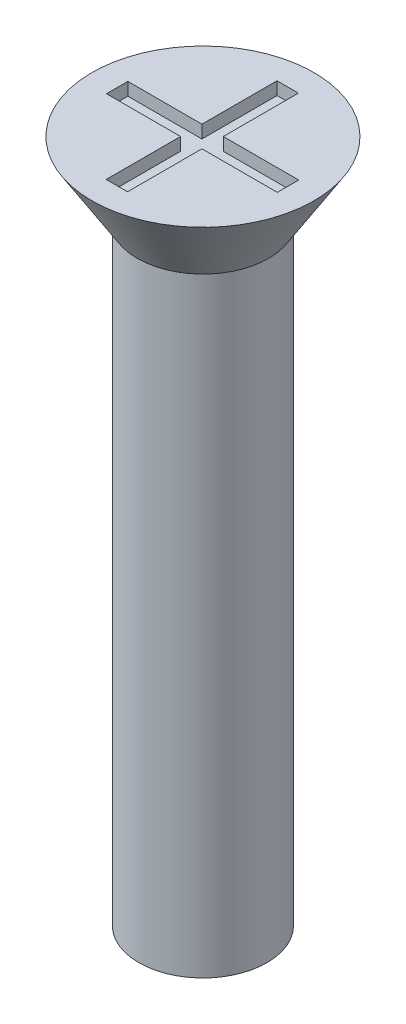
ISO-10303-21;
HEADER;
FILE_DESCRIPTION(('STEP AP214'),'2;1');
FILE_NAME('part.step','',(''),(''),'','','');
FILE_SCHEMA(('AUTOMOTIVE_DESIGN { 1 0 10303 214 1 1 1 1 }'));
ENDSEC;
DATA;
#1=APPLICATION_CONTEXT('core data for automotive mechanical design processes');
#2=APPLICATION_PROTOCOL_DEFINITION('international standard','automotive_design',2000,#1);
#3=PRODUCT_CONTEXT('',#1,'mechanical');
#4=PRODUCT('Part','Part','',(#3));
#5=PRODUCT_RELATED_PRODUCT_CATEGORY('part','',(#4));
#6=PRODUCT_DEFINITION_FORMATION('','',#4);
#7=PRODUCT_DEFINITION_CONTEXT('part definition',#1,'design');
#8=PRODUCT_DEFINITION('design','',#6,#7);
#9=PRODUCT_DEFINITION_SHAPE('','',#8);
#10=(LENGTH_UNIT() NAMED_UNIT(*) SI_UNIT(.MILLI.,.METRE.));
#11=(NAMED_UNIT(*) PLANE_ANGLE_UNIT() SI_UNIT($,.RADIAN.));
#12=(NAMED_UNIT(*) SI_UNIT($,.STERADIAN.) SOLID_ANGLE_UNIT());
#13=UNCERTAINTY_MEASURE_WITH_UNIT(LENGTH_MEASURE(1.E-05),#10,'distance_accuracy_value','');
#14=(GEOMETRIC_REPRESENTATION_CONTEXT(3) GLOBAL_UNCERTAINTY_ASSIGNED_CONTEXT((#13)) GLOBAL_UNIT_ASSIGNED_CONTEXT((#10,
#11,#12)) REPRESENTATION_CONTEXT('',''));
#15=CARTESIAN_POINT('',(0.,0.,0.));
#16=DIRECTION('',(0.,0.,1.));
#17=DIRECTION('',(1.,0.,0.));
#18=AXIS2_PLACEMENT_3D('',#15,#16,#17);
#19=CARTESIAN_POINT('',(0.,16.,0.));
#20=DIRECTION('',(0.,1.,0.));
#21=DIRECTION('',(0.,0.,1.));
#22=AXIS2_PLACEMENT_3D('',#19,#20,#21);
#23=PLANE('',#22);
#24=CARTESIAN_POINT('',(0.,16.,0.));
#25=DIRECTION('',(0.,1.,0.));
#26=DIRECTION('',(0.,0.,1.));
#27=AXIS2_PLACEMENT_3D('',#24,#25,#26);
#28=CIRCLE('',#27,2.6);
#29=CARTESIAN_POINT('',(0.,16.,2.6));
#30=VERTEX_POINT('',#29);
#31=EDGE_CURVE('E192',#30,#30,#28,.T.);
#32=ORIENTED_EDGE('',*,*,#31,.T.);
#33=EDGE_LOOP('',(#32));
#34=FACE_BOUND('',#33,.T.);
#35=DIRECTION('',(1.,0.,0.));
#36=VECTOR('',#35,1.);
#37=CARTESIAN_POINT('',(0.,16.,-2.));
#38=LINE('',#37,#36);
#39=CARTESIAN_POINT('',(-0.265272843023468,16.,-2.));
#40=VERTEX_POINT('',#39);
#41=CARTESIAN_POINT('',(0.234727156976532,16.,-2.));
#42=VERTEX_POINT('',#41);
#43=EDGE_CURVE('E161',#40,#42,#38,.T.);
#44=ORIENTED_EDGE('',*,*,#43,.T.);
#45=DIRECTION('',(0.,0.,1.));
#46=VECTOR('',#45,1.);
#47=CARTESIAN_POINT('',(0.234727156976532,16.,0.));
#48=LINE('',#47,#46);
#49=CARTESIAN_POINT('',(0.234727156976532,16.,-0.241621514992573));
#50=VERTEX_POINT('',#49);
#51=EDGE_CURVE('E48',#42,#50,#48,.T.);
#52=ORIENTED_EDGE('',*,*,#51,.T.);
#53=DIRECTION('',(1.,0.,0.));
#54=VECTOR('',#53,1.);
#55=CARTESIAN_POINT('',(0.,16.,-0.241621514992573));
#56=LINE('',#55,#54);
#57=CARTESIAN_POINT('',(2.,16.,-0.241621514992573));
#58=VERTEX_POINT('',#57);
#59=EDGE_CURVE('E98',#50,#58,#56,.T.);
#60=ORIENTED_EDGE('',*,*,#59,.T.);
#61=DIRECTION('',(0.,0.,1.));
#62=VECTOR('',#61,1.);
#63=CARTESIAN_POINT('',(2.,16.,0.));
#64=LINE('',#63,#62);
#65=CARTESIAN_POINT('',(2.,16.,0.258378485007427));
#66=VERTEX_POINT('',#65);
#67=EDGE_CURVE('E186',#58,#66,#64,.T.);
#68=ORIENTED_EDGE('',*,*,#67,.T.);
#69=DIRECTION('',(1.,0.,0.));
#70=VECTOR('',#69,1.);
#71=CARTESIAN_POINT('',(0.,16.,0.258378485007427));
#72=LINE('',#71,#70);
#73=CARTESIAN_POINT('',(0.234727156976532,16.,0.258378485007427));
#74=VERTEX_POINT('',#73);
#75=EDGE_CURVE('E145',#74,#66,#72,.T.);
#76=ORIENTED_EDGE('',*,*,#75,.F.);
#77=DIRECTION('',(0.,0.,1.));
#78=VECTOR('',#77,1.);
#79=CARTESIAN_POINT('',(0.234727156976532,16.,0.));
#80=LINE('',#79,#78);
#81=CARTESIAN_POINT('',(0.234727156976533,16.,2.));
#82=VERTEX_POINT('',#81);
#83=EDGE_CURVE('E182',#74,#82,#80,.T.);
#84=ORIENTED_EDGE('',*,*,#83,.T.);
#85=DIRECTION('',(1.,0.,0.));
#86=VECTOR('',#85,1.);
#87=CARTESIAN_POINT('',(0.,16.,2.));
#88=LINE('',#87,#86);
#89=CARTESIAN_POINT('',(-0.265272843023467,16.,2.));
#90=VERTEX_POINT('',#89);
#91=EDGE_CURVE('E179',#90,#82,#88,.T.);
#92=ORIENTED_EDGE('',*,*,#91,.F.);
#93=DIRECTION('',(0.,0.,1.));
#94=VECTOR('',#93,1.);
#95=CARTESIAN_POINT('',(-0.265272843023468,16.,0.));
#96=LINE('',#95,#94);
#97=CARTESIAN_POINT('',(-0.265272843023468,16.,0.258378485007427));
#98=VERTEX_POINT('',#97);
#99=EDGE_CURVE('E176',#98,#90,#96,.T.);
#100=ORIENTED_EDGE('',*,*,#99,.F.);
#101=DIRECTION('',(1.,0.,0.));
#102=VECTOR('',#101,1.);
#103=CARTESIAN_POINT('',(0.,16.,0.258378485007427));
#104=LINE('',#103,#102);
#105=CARTESIAN_POINT('',(-2.,16.,0.258378485007427));
#106=VERTEX_POINT('',#105);
#107=EDGE_CURVE('E173',#106,#98,#104,.T.);
#108=ORIENTED_EDGE('',*,*,#107,.F.);
#109=DIRECTION('',(0.,0.,1.));
#110=VECTOR('',#109,1.);
#111=CARTESIAN_POINT('',(-2.,16.,0.));
#112=LINE('',#111,#110);
#113=CARTESIAN_POINT('',(-2.,16.,-0.241621514992573));
#114=VERTEX_POINT('',#113);
#115=EDGE_CURVE('E170',#114,#106,#112,.T.);
#116=ORIENTED_EDGE('',*,*,#115,.F.);
#117=DIRECTION('',(1.,0.,0.));
#118=VECTOR('',#117,1.);
#119=CARTESIAN_POINT('',(0.,16.,-0.241621514992573));
#120=LINE('',#119,#118);
#121=CARTESIAN_POINT('',(-0.265272843023468,16.,-0.241621514992573));
#122=VERTEX_POINT('',#121);
#123=EDGE_CURVE('E167',#114,#122,#120,.T.);
#124=ORIENTED_EDGE('',*,*,#123,.T.);
#125=DIRECTION('',(0.,0.,1.));
#126=VECTOR('',#125,1.);
#127=CARTESIAN_POINT('',(-0.265272843023468,16.,0.));
#128=LINE('',#127,#126);
#129=EDGE_CURVE('E164',#40,#122,#128,.T.);
#130=ORIENTED_EDGE('',*,*,#129,.F.);
#131=EDGE_LOOP('',(#44,#52,#60,#68,#76,#84,#92,#100,#108,#116,#124,#130));
#132=FACE_BOUND('',#131,.T.);
#133=ADVANCED_FACE('F33',(#34,#132),#23,.T.);
#134=CARTESIAN_POINT('',(0.,16.,0.));
#135=DIRECTION('',(0.,-1.,0.));
#136=DIRECTION('',(0.,0.,-1.));
#137=AXIS2_PLACEMENT_3D('',#134,#135,#136);
#138=CYLINDRICAL_SURFACE('',#137,1.5);
#139=CARTESIAN_POINT('',(0.,0.,0.));
#140=DIRECTION('',(0.,1.,0.));
#141=DIRECTION('',(0.,0.,1.));
#142=AXIS2_PLACEMENT_3D('',#139,#140,#141);
#143=CIRCLE('',#142,1.5);
#144=CARTESIAN_POINT('',(0.,0.,1.5));
#145=VERTEX_POINT('',#144);
#146=EDGE_CURVE('E41',#145,#145,#143,.T.);
#147=ORIENTED_EDGE('',*,*,#146,.T.);
#148=EDGE_LOOP('',(#147));
#149=FACE_BOUND('',#148,.T.);
#150=CARTESIAN_POINT('',(0.,14.3,0.));
#151=DIRECTION('',(0.,1.,0.));
#152=DIRECTION('',(0.,0.,1.));
#153=AXIS2_PLACEMENT_3D('',#150,#151,#152);
#154=CIRCLE('',#153,1.5);
#155=CARTESIAN_POINT('',(0.,14.3,1.5));
#156=VERTEX_POINT('',#155);
#157=EDGE_CURVE('E11',#156,#156,#154,.T.);
#158=ORIENTED_EDGE('',*,*,#157,.F.);
#159=EDGE_LOOP('',(#158));
#160=FACE_BOUND('',#159,.T.);
#161=ADVANCED_FACE('F35',(#149,#160),#138,.T.);
#162=CARTESIAN_POINT('',(0.,0.,0.));
#163=DIRECTION('',(0.,1.,0.));
#164=DIRECTION('',(0.,0.,1.));
#165=AXIS2_PLACEMENT_3D('',#162,#163,#164);
#166=PLANE('',#165);
#167=ORIENTED_EDGE('',*,*,#146,.F.);
#168=EDGE_LOOP('',(#167));
#169=FACE_BOUND('',#168,.T.);
#170=ADVANCED_FACE('F219',(#169),#166,.F.);
#171=CARTESIAN_POINT('',(0.,16.,0.));
#172=DIRECTION('',(0.,1.,0.));
#173=DIRECTION('',(0.,0.,1.));
#174=AXIS2_PLACEMENT_3D('',#171,#172,#173);
#175=CONICAL_SURFACE('',#174,2.6,0.558505360638187);
#176=CARTESIAN_POINT('',(0.,14.3,0.));
#177=DIRECTION('',(0.,1.,0.));
#178=DIRECTION('',(0.,0.,1.));
#179=AXIS2_PLACEMENT_3D('',#176,#177,#178);
#180=CIRCLE('',#179,1.53772210175414);
#181=CARTESIAN_POINT('',(0.,14.3,1.53772210175414));
#182=VERTEX_POINT('',#181);
#183=EDGE_CURVE('E212',#182,#182,#180,.T.);
#184=ORIENTED_EDGE('',*,*,#183,.T.);
#185=EDGE_LOOP('',(#184));
#186=FACE_BOUND('',#185,.T.);
#187=ORIENTED_EDGE('',*,*,#31,.F.);
#188=EDGE_LOOP('',(#187));
#189=FACE_BOUND('',#188,.T.);
#190=ADVANCED_FACE('F221',(#186,#189),#175,.T.);
#191=CARTESIAN_POINT('',(0.,14.3,0.));
#192=DIRECTION('',(0.,1.,0.));
#193=DIRECTION('',(0.,0.,1.));
#194=AXIS2_PLACEMENT_3D('',#191,#192,#193);
#195=PLANE('',#194);
#196=ORIENTED_EDGE('',*,*,#157,.T.);
#197=EDGE_LOOP('',(#196));
#198=FACE_BOUND('',#197,.T.);
#199=ORIENTED_EDGE('',*,*,#183,.F.);
#200=EDGE_LOOP('',(#199));
#201=FACE_BOUND('',#200,.T.);
#202=ADVANCED_FACE('F226',(#198,#201),#195,.F.);
#203=CARTESIAN_POINT('',(0.234727156976532,15.7,0.));
#204=DIRECTION('',(-1.,0.,0.));
#205=DIRECTION('',(0.,0.,1.));
#206=AXIS2_PLACEMENT_3D('',#203,#204,#205);
#207=PLANE('',#206);
#208=ORIENTED_EDGE('',*,*,#51,.F.);
#209=DIRECTION('',(0.,1.,0.));
#210=VECTOR('',#209,1.);
#211=CARTESIAN_POINT('',(0.234727156976532,15.7,-2.));
#212=LINE('',#211,#210);
#213=CARTESIAN_POINT('',(0.234727156976532,15.7,-2.));
#214=VERTEX_POINT('',#213);
#215=EDGE_CURVE('E159',#214,#42,#212,.T.);
#216=ORIENTED_EDGE('',*,*,#215,.F.);
#217=DIRECTION('',(0.,0.,1.));
#218=VECTOR('',#217,1.);
#219=CARTESIAN_POINT('',(0.234727156976532,15.7,0.));
#220=LINE('',#219,#218);
#221=CARTESIAN_POINT('',(0.234727156976532,15.7,-0.241621514992573));
#222=VERTEX_POINT('',#221);
#223=EDGE_CURVE('E189',#214,#222,#220,.T.);
#224=ORIENTED_EDGE('',*,*,#223,.T.);
#225=DIRECTION('',(0.,1.,0.));
#226=VECTOR('',#225,1.);
#227=CARTESIAN_POINT('',(0.234727156976532,15.7,-0.241621514992573));
#228=LINE('',#227,#226);
#229=EDGE_CURVE('E190',#222,#50,#228,.T.);
#230=ORIENTED_EDGE('',*,*,#229,.T.);
#231=EDGE_LOOP('',(#208,#216,#224,#230));
#232=FACE_BOUND('',#231,.T.);
#233=ADVANCED_FACE('F238',(#232),#207,.T.);
#234=CARTESIAN_POINT('',(0.,15.7,-0.241621514992573));
#235=DIRECTION('',(0.,0.,1.));
#236=DIRECTION('',(1.,0.,0.));
#237=AXIS2_PLACEMENT_3D('',#234,#235,#236);
#238=PLANE('',#237);
#239=ORIENTED_EDGE('',*,*,#59,.F.);
#240=ORIENTED_EDGE('',*,*,#229,.F.);
#241=DIRECTION('',(1.,0.,0.));
#242=VECTOR('',#241,1.);
#243=CARTESIAN_POINT('',(0.,15.7,-0.241621514992573));
#244=LINE('',#243,#242);
#245=CARTESIAN_POINT('',(2.,15.7,-0.241621514992573));
#246=VERTEX_POINT('',#245);
#247=EDGE_CURVE('E57',#222,#246,#244,.T.);
#248=ORIENTED_EDGE('',*,*,#247,.T.);
#249=DIRECTION('',(0.,1.,0.));
#250=VECTOR('',#249,1.);
#251=CARTESIAN_POINT('',(2.,15.7,-0.241621514992573));
#252=LINE('',#251,#250);
#253=EDGE_CURVE('E137',#246,#58,#252,.T.);
#254=ORIENTED_EDGE('',*,*,#253,.T.);
#255=EDGE_LOOP('',(#239,#240,#248,#254));
#256=FACE_BOUND('',#255,.T.);
#257=ADVANCED_FACE('F242',(#256),#238,.T.);
#258=CARTESIAN_POINT('',(2.,15.7,0.));
#259=DIRECTION('',(-1.,0.,0.));
#260=DIRECTION('',(0.,0.,1.));
#261=AXIS2_PLACEMENT_3D('',#258,#259,#260);
#262=PLANE('',#261);
#263=ORIENTED_EDGE('',*,*,#67,.F.);
#264=ORIENTED_EDGE('',*,*,#253,.F.);
#265=DIRECTION('',(0.,0.,1.));
#266=VECTOR('',#265,1.);
#267=CARTESIAN_POINT('',(2.,15.7,0.));
#268=LINE('',#267,#266);
#269=CARTESIAN_POINT('',(2.,15.7,0.258378485007427));
#270=VERTEX_POINT('',#269);
#271=EDGE_CURVE('E131',#246,#270,#268,.T.);
#272=ORIENTED_EDGE('',*,*,#271,.T.);
#273=DIRECTION('',(0.,1.,0.));
#274=VECTOR('',#273,1.);
#275=CARTESIAN_POINT('',(2.,15.7,0.258378485007427));
#276=LINE('',#275,#274);
#277=EDGE_CURVE('E135',#270,#66,#276,.T.);
#278=ORIENTED_EDGE('',*,*,#277,.T.);
#279=EDGE_LOOP('',(#263,#264,#272,#278));
#280=FACE_BOUND('',#279,.T.);
#281=ADVANCED_FACE('F134',(#280),#262,.T.);
#282=CARTESIAN_POINT('',(0.,15.7,0.258378485007427));
#283=DIRECTION('',(0.,0.,1.));
#284=DIRECTION('',(1.,0.,0.));
#285=AXIS2_PLACEMENT_3D('',#282,#283,#284);
#286=PLANE('',#285);
#287=ORIENTED_EDGE('',*,*,#75,.T.);
#288=ORIENTED_EDGE('',*,*,#277,.F.);
#289=DIRECTION('',(1.,0.,0.));
#290=VECTOR('',#289,1.);
#291=CARTESIAN_POINT('',(0.,15.7,0.258378485007427));
#292=LINE('',#291,#290);
#293=CARTESIAN_POINT('',(0.234727156976532,15.7,0.258378485007427));
#294=VERTEX_POINT('',#293);
#295=EDGE_CURVE('E139',#294,#270,#292,.T.);
#296=ORIENTED_EDGE('',*,*,#295,.F.);
#297=DIRECTION('',(0.,1.,0.));
#298=VECTOR('',#297,1.);
#299=CARTESIAN_POINT('',(0.234727156976532,15.7,0.258378485007427));
#300=LINE('',#299,#298);
#301=EDGE_CURVE('E147',#294,#74,#300,.T.);
#302=ORIENTED_EDGE('',*,*,#301,.T.);
#303=EDGE_LOOP('',(#287,#288,#296,#302));
#304=FACE_BOUND('',#303,.T.);
#305=ADVANCED_FACE('F143',(#304),#286,.F.);
#306=CARTESIAN_POINT('',(0.234727156976532,15.7,0.));
#307=DIRECTION('',(-1.,0.,0.));
#308=DIRECTION('',(0.,0.,1.));
#309=AXIS2_PLACEMENT_3D('',#306,#307,#308);
#310=PLANE('',#309);
#311=ORIENTED_EDGE('',*,*,#83,.F.);
#312=ORIENTED_EDGE('',*,*,#301,.F.);
#313=DIRECTION('',(0.,0.,1.));
#314=VECTOR('',#313,1.);
#315=CARTESIAN_POINT('',(0.234727156976532,15.7,0.));
#316=LINE('',#315,#314);
#317=CARTESIAN_POINT('',(0.234727156976533,15.7,2.));
#318=VERTEX_POINT('',#317);
#319=EDGE_CURVE('E152',#294,#318,#316,.T.);
#320=ORIENTED_EDGE('',*,*,#319,.T.);
#321=DIRECTION('',(0.,1.,0.));
#322=VECTOR('',#321,1.);
#323=CARTESIAN_POINT('',(0.234727156976533,15.7,2.));
#324=LINE('',#323,#322);
#325=EDGE_CURVE('E195',#318,#82,#324,.T.);
#326=ORIENTED_EDGE('',*,*,#325,.T.);
#327=EDGE_LOOP('',(#311,#312,#320,#326));
#328=FACE_BOUND('',#327,.T.);
#329=ADVANCED_FACE('F269',(#328),#310,.T.);
#330=CARTESIAN_POINT('',(0.,15.7,2.));
#331=DIRECTION('',(0.,0.,1.));
#332=DIRECTION('',(1.,0.,0.));
#333=AXIS2_PLACEMENT_3D('',#330,#331,#332);
#334=PLANE('',#333);
#335=ORIENTED_EDGE('',*,*,#91,.T.);
#336=ORIENTED_EDGE('',*,*,#325,.F.);
#337=DIRECTION('',(1.,0.,0.));
#338=VECTOR('',#337,1.);
#339=CARTESIAN_POINT('',(0.,15.7,2.));
#340=LINE('',#339,#338);
#341=CARTESIAN_POINT('',(-0.265272843023467,15.7,2.));
#342=VERTEX_POINT('',#341);
#343=EDGE_CURVE('E154',#342,#318,#340,.T.);
#344=ORIENTED_EDGE('',*,*,#343,.F.);
#345=DIRECTION('',(0.,1.,0.));
#346=VECTOR('',#345,1.);
#347=CARTESIAN_POINT('',(-0.265272843023467,15.7,2.));
#348=LINE('',#347,#346);
#349=EDGE_CURVE('E197',#342,#90,#348,.T.);
#350=ORIENTED_EDGE('',*,*,#349,.T.);
#351=EDGE_LOOP('',(#335,#336,#344,#350));
#352=FACE_BOUND('',#351,.T.);
#353=ADVANCED_FACE('F265',(#352),#334,.F.);
#354=CARTESIAN_POINT('',(-0.265272843023468,15.7,0.));
#355=DIRECTION('',(-1.,0.,0.));
#356=DIRECTION('',(0.,0.,1.));
#357=AXIS2_PLACEMENT_3D('',#354,#355,#356);
#358=PLANE('',#357);
#359=ORIENTED_EDGE('',*,*,#99,.T.);
#360=ORIENTED_EDGE('',*,*,#349,.F.);
#361=DIRECTION('',(0.,0.,1.));
#362=VECTOR('',#361,1.);
#363=CARTESIAN_POINT('',(-0.265272843023468,15.7,0.));
#364=LINE('',#363,#362);
#365=CARTESIAN_POINT('',(-0.265272843023468,15.7,0.258378485007427));
#366=VERTEX_POINT('',#365);
#367=EDGE_CURVE('E417',#366,#342,#364,.T.);
#368=ORIENTED_EDGE('',*,*,#367,.F.);
#369=DIRECTION('',(0.,1.,0.));
#370=VECTOR('',#369,1.);
#371=CARTESIAN_POINT('',(-0.265272843023468,15.7,0.258378485007427));
#372=LINE('',#371,#370);
#373=EDGE_CURVE('E199',#366,#98,#372,.T.);
#374=ORIENTED_EDGE('',*,*,#373,.T.);
#375=EDGE_LOOP('',(#359,#360,#368,#374));
#376=FACE_BOUND('',#375,.T.);
#377=ADVANCED_FACE('F261',(#376),#358,.F.);
#378=CARTESIAN_POINT('',(0.,15.7,0.258378485007427));
#379=DIRECTION('',(0.,0.,1.));
#380=DIRECTION('',(1.,0.,0.));
#381=AXIS2_PLACEMENT_3D('',#378,#379,#380);
#382=PLANE('',#381);
#383=ORIENTED_EDGE('',*,*,#107,.T.);
#384=ORIENTED_EDGE('',*,*,#373,.F.);
#385=DIRECTION('',(1.,0.,0.));
#386=VECTOR('',#385,1.);
#387=CARTESIAN_POINT('',(0.,15.7,0.258378485007427));
#388=LINE('',#387,#386);
#389=CARTESIAN_POINT('',(-2.,15.7,0.258378485007427));
#390=VERTEX_POINT('',#389);
#391=EDGE_CURVE('E414',#390,#366,#388,.T.);
#392=ORIENTED_EDGE('',*,*,#391,.F.);
#393=DIRECTION('',(0.,1.,0.));
#394=VECTOR('',#393,1.);
#395=CARTESIAN_POINT('',(-2.,15.7,0.258378485007427));
#396=LINE('',#395,#394);
#397=EDGE_CURVE('E201',#390,#106,#396,.T.);
#398=ORIENTED_EDGE('',*,*,#397,.T.);
#399=EDGE_LOOP('',(#383,#384,#392,#398));
#400=FACE_BOUND('',#399,.T.);
#401=ADVANCED_FACE('F257',(#400),#382,.F.);
#402=CARTESIAN_POINT('',(-2.,15.7,0.));
#403=DIRECTION('',(-1.,0.,0.));
#404=DIRECTION('',(0.,0.,1.));
#405=AXIS2_PLACEMENT_3D('',#402,#403,#404);
#406=PLANE('',#405);
#407=ORIENTED_EDGE('',*,*,#115,.T.);
#408=ORIENTED_EDGE('',*,*,#397,.F.);
#409=DIRECTION('',(0.,0.,1.));
#410=VECTOR('',#409,1.);
#411=CARTESIAN_POINT('',(-2.,15.7,0.));
#412=LINE('',#411,#410);
#413=CARTESIAN_POINT('',(-2.,15.7,-0.241621514992573));
#414=VERTEX_POINT('',#413);
#415=EDGE_CURVE('E411',#414,#390,#412,.T.);
#416=ORIENTED_EDGE('',*,*,#415,.F.);
#417=DIRECTION('',(0.,1.,0.));
#418=VECTOR('',#417,1.);
#419=CARTESIAN_POINT('',(-2.,15.7,-0.241621514992573));
#420=LINE('',#419,#418);
#421=EDGE_CURVE('E203',#414,#114,#420,.T.);
#422=ORIENTED_EDGE('',*,*,#421,.T.);
#423=EDGE_LOOP('',(#407,#408,#416,#422));
#424=FACE_BOUND('',#423,.T.);
#425=ADVANCED_FACE('F253',(#424),#406,.F.);
#426=CARTESIAN_POINT('',(0.,15.7,-0.241621514992573));
#427=DIRECTION('',(0.,0.,1.));
#428=DIRECTION('',(1.,0.,0.));
#429=AXIS2_PLACEMENT_3D('',#426,#427,#428);
#430=PLANE('',#429);
#431=ORIENTED_EDGE('',*,*,#123,.F.);
#432=ORIENTED_EDGE('',*,*,#421,.F.);
#433=DIRECTION('',(1.,0.,0.));
#434=VECTOR('',#433,1.);
#435=CARTESIAN_POINT('',(0.,15.7,-0.241621514992573));
#436=LINE('',#435,#434);
#437=CARTESIAN_POINT('',(-0.265272843023468,15.7,-0.241621514992573));
#438=VERTEX_POINT('',#437);
#439=EDGE_CURVE('E409',#414,#438,#436,.T.);
#440=ORIENTED_EDGE('',*,*,#439,.T.);
#441=DIRECTION('',(0.,1.,0.));
#442=VECTOR('',#441,1.);
#443=CARTESIAN_POINT('',(-0.265272843023468,15.7,-0.241621514992573));
#444=LINE('',#443,#442);
#445=EDGE_CURVE('E205',#438,#122,#444,.T.);
#446=ORIENTED_EDGE('',*,*,#445,.T.);
#447=EDGE_LOOP('',(#431,#432,#440,#446));
#448=FACE_BOUND('',#447,.T.);
#449=ADVANCED_FACE('F249',(#448),#430,.T.);
#450=CARTESIAN_POINT('',(-0.265272843023468,15.7,0.));
#451=DIRECTION('',(-1.,0.,0.));
#452=DIRECTION('',(0.,0.,1.));
#453=AXIS2_PLACEMENT_3D('',#450,#451,#452);
#454=PLANE('',#453);
#455=ORIENTED_EDGE('',*,*,#129,.T.);
#456=ORIENTED_EDGE('',*,*,#445,.F.);
#457=DIRECTION('',(0.,0.,1.));
#458=VECTOR('',#457,1.);
#459=CARTESIAN_POINT('',(-0.265272843023468,15.7,0.));
#460=LINE('',#459,#458);
#461=CARTESIAN_POINT('',(-0.265272843023468,15.7,-2.));
#462=VERTEX_POINT('',#461);
#463=EDGE_CURVE('E405',#462,#438,#460,.T.);
#464=ORIENTED_EDGE('',*,*,#463,.F.);
#465=DIRECTION('',(0.,1.,0.));
#466=VECTOR('',#465,1.);
#467=CARTESIAN_POINT('',(-0.265272843023468,15.7,-2.));
#468=LINE('',#467,#466);
#469=EDGE_CURVE('E207',#462,#40,#468,.T.);
#470=ORIENTED_EDGE('',*,*,#469,.T.);
#471=EDGE_LOOP('',(#455,#456,#464,#470));
#472=FACE_BOUND('',#471,.T.);
#473=ADVANCED_FACE('F246',(#472),#454,.F.);
#474=CARTESIAN_POINT('',(0.,15.7,-2.));
#475=DIRECTION('',(0.,0.,1.));
#476=DIRECTION('',(1.,0.,0.));
#477=AXIS2_PLACEMENT_3D('',#474,#475,#476);
#478=PLANE('',#477);
#479=ORIENTED_EDGE('',*,*,#43,.F.);
#480=ORIENTED_EDGE('',*,*,#469,.F.);
#481=DIRECTION('',(1.,0.,0.));
#482=VECTOR('',#481,1.);
#483=CARTESIAN_POINT('',(0.,15.7,-2.));
#484=LINE('',#483,#482);
#485=EDGE_CURVE('E105',#462,#214,#484,.T.);
#486=ORIENTED_EDGE('',*,*,#485,.T.);
#487=ORIENTED_EDGE('',*,*,#215,.T.);
#488=EDGE_LOOP('',(#479,#480,#486,#487));
#489=FACE_BOUND('',#488,.T.);
#490=ADVANCED_FACE('F243',(#489),#478,.T.);
#491=CARTESIAN_POINT('',(0.,15.7,0.));
#492=DIRECTION('',(0.,1.,0.));
#493=DIRECTION('',(0.,0.,1.));
#494=AXIS2_PLACEMENT_3D('',#491,#492,#493);
#495=PLANE('',#494);
#496=ORIENTED_EDGE('',*,*,#223,.F.);
#497=ORIENTED_EDGE('',*,*,#485,.F.);
#498=ORIENTED_EDGE('',*,*,#463,.T.);
#499=ORIENTED_EDGE('',*,*,#439,.F.);
#500=ORIENTED_EDGE('',*,*,#415,.T.);
#501=ORIENTED_EDGE('',*,*,#391,.T.);
#502=ORIENTED_EDGE('',*,*,#367,.T.);
#503=ORIENTED_EDGE('',*,*,#343,.T.);
#504=ORIENTED_EDGE('',*,*,#319,.F.);
#505=ORIENTED_EDGE('',*,*,#295,.T.);
#506=ORIENTED_EDGE('',*,*,#271,.F.);
#507=ORIENTED_EDGE('',*,*,#247,.F.);
#508=EDGE_LOOP('',(#496,#497,#498,#499,#500,#501,#502,#503,#504,#505,#506,#507));
#509=FACE_BOUND('',#508,.T.);
#510=ADVANCED_FACE('F150',(#509),#495,.T.);
#511=CLOSED_SHELL('',(#133,#161,#170,#190,#202,#233,#257,#281,#305,#329,#353,#377,#401,#425,
#449,#473,#490,#510));
#512=MANIFOLD_SOLID_BREP('B2',#511);
#513=ADVANCED_BREP_SHAPE_REPRESENTATION('',(#18,#512),#14);
#514=SHAPE_DEFINITION_REPRESENTATION(#9,#513);
ENDSEC;
END-ISO-10303-21;
